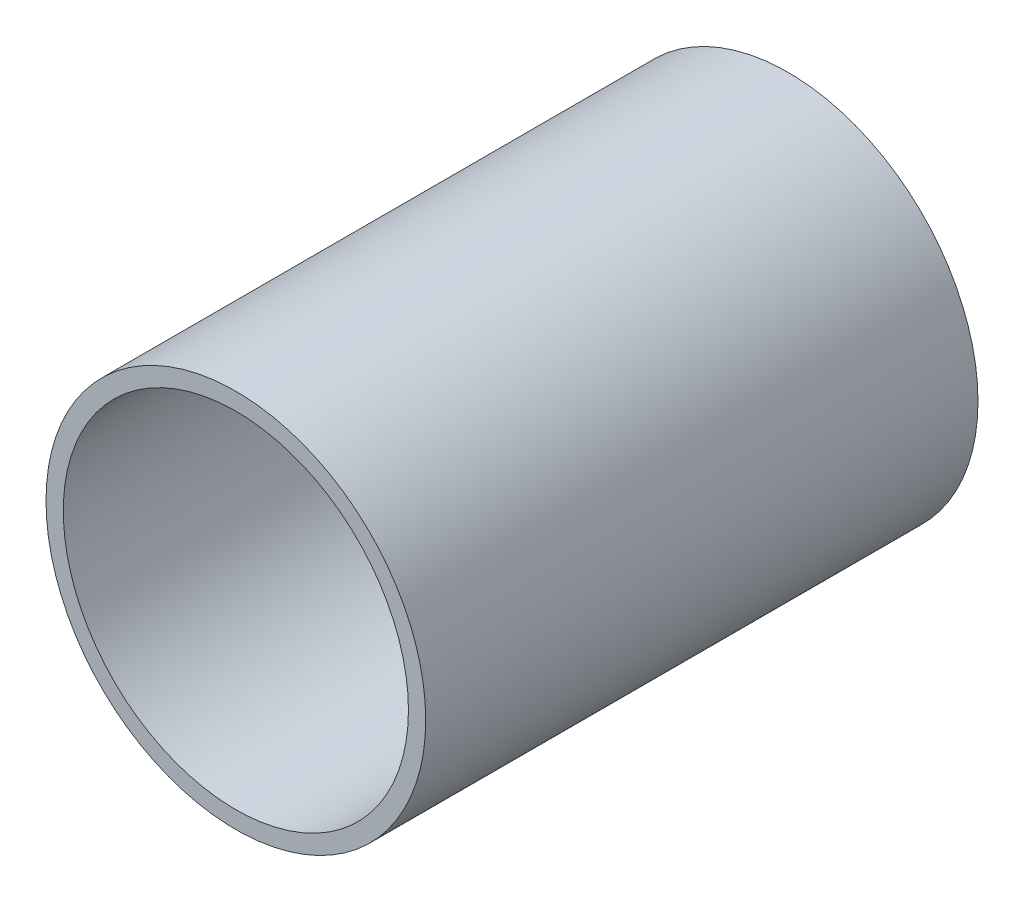
ISO-10303-21;
HEADER;
FILE_DESCRIPTION(('STEP AP214'),'2;1');
FILE_NAME('part.step','',(''),(''),'','','');
FILE_SCHEMA(('AUTOMOTIVE_DESIGN { 1 0 10303 214 1 1 1 1 }'));
ENDSEC;
DATA;
#1=APPLICATION_CONTEXT('core data for automotive mechanical design processes');
#2=APPLICATION_PROTOCOL_DEFINITION('international standard','automotive_design',2000,#1);
#3=PRODUCT_CONTEXT('',#1,'mechanical');
#4=PRODUCT('Part','Part','',(#3));
#5=PRODUCT_RELATED_PRODUCT_CATEGORY('part','',(#4));
#6=PRODUCT_DEFINITION_FORMATION('','',#4);
#7=PRODUCT_DEFINITION_CONTEXT('part definition',#1,'design');
#8=PRODUCT_DEFINITION('design','',#6,#7);
#9=PRODUCT_DEFINITION_SHAPE('','',#8);
#10=(LENGTH_UNIT() NAMED_UNIT(*) SI_UNIT(.MILLI.,.METRE.));
#11=(NAMED_UNIT(*) PLANE_ANGLE_UNIT() SI_UNIT($,.RADIAN.));
#12=(NAMED_UNIT(*) SI_UNIT($,.STERADIAN.) SOLID_ANGLE_UNIT());
#13=UNCERTAINTY_MEASURE_WITH_UNIT(LENGTH_MEASURE(1.E-05),#10,'distance_accuracy_value','');
#14=(GEOMETRIC_REPRESENTATION_CONTEXT(3) GLOBAL_UNCERTAINTY_ASSIGNED_CONTEXT((#13)) GLOBAL_UNIT_ASSIGNED_CONTEXT((#10,
#11,#12)) REPRESENTATION_CONTEXT('',''));
#15=CARTESIAN_POINT('',(0.,0.,0.));
#16=DIRECTION('',(0.,0.,1.));
#17=DIRECTION('',(1.,0.,0.));
#18=AXIS2_PLACEMENT_3D('',#15,#16,#17);
#19=CARTESIAN_POINT('',(0.,0.,40.));
#20=DIRECTION('',(0.,0.,1.));
#21=DIRECTION('',(1.,0.,0.));
#22=AXIS2_PLACEMENT_3D('',#19,#20,#21);
#23=PLANE('',#22);
#24=CARTESIAN_POINT('',(0.,0.,40.));
#25=DIRECTION('',(0.,0.,1.));
#26=DIRECTION('',(1.,0.,0.));
#27=AXIS2_PLACEMENT_3D('',#24,#25,#26);
#28=CIRCLE('',#27,13.75);
#29=CARTESIAN_POINT('',(13.75,0.,40.));
#30=VERTEX_POINT('',#29);
#31=EDGE_CURVE('E10',#30,#30,#28,.T.);
#32=ORIENTED_EDGE('',*,*,#31,.T.);
#33=EDGE_LOOP('',(#32));
#34=FACE_BOUND('',#33,.T.);
#35=CARTESIAN_POINT('',(0.,0.,40.));
#36=DIRECTION('',(0.,0.,1.));
#37=DIRECTION('',(1.,0.,0.));
#38=AXIS2_PLACEMENT_3D('',#35,#36,#37);
#39=CIRCLE('',#38,12.5);
#40=CARTESIAN_POINT('',(12.5,0.,40.));
#41=VERTEX_POINT('',#40);
#42=EDGE_CURVE('E40',#41,#41,#39,.T.);
#43=ORIENTED_EDGE('',*,*,#42,.F.);
#44=EDGE_LOOP('',(#43));
#45=FACE_BOUND('',#44,.T.);
#46=ADVANCED_FACE('F29',(#34,#45),#23,.T.);
#47=CARTESIAN_POINT('',(0.,0.,0.));
#48=DIRECTION('',(0.,0.,1.));
#49=DIRECTION('',(1.,0.,0.));
#50=AXIS2_PLACEMENT_3D('',#47,#48,#49);
#51=PLANE('',#50);
#52=CARTESIAN_POINT('',(0.,0.,0.));
#53=DIRECTION('',(0.,0.,1.));
#54=DIRECTION('',(1.,0.,0.));
#55=AXIS2_PLACEMENT_3D('',#52,#53,#54);
#56=CIRCLE('',#55,13.75);
#57=CARTESIAN_POINT('',(13.75,0.,0.));
#58=VERTEX_POINT('',#57);
#59=EDGE_CURVE('E36',#58,#58,#56,.T.);
#60=ORIENTED_EDGE('',*,*,#59,.F.);
#61=EDGE_LOOP('',(#60));
#62=FACE_BOUND('',#61,.T.);
#63=CARTESIAN_POINT('',(0.,0.,0.));
#64=DIRECTION('',(0.,0.,1.));
#65=DIRECTION('',(1.,0.,0.));
#66=AXIS2_PLACEMENT_3D('',#63,#64,#65);
#67=CIRCLE('',#66,12.5);
#68=CARTESIAN_POINT('',(12.5,0.,0.));
#69=VERTEX_POINT('',#68);
#70=EDGE_CURVE('E44',#69,#69,#67,.T.);
#71=ORIENTED_EDGE('',*,*,#70,.T.);
#72=EDGE_LOOP('',(#71));
#73=FACE_BOUND('',#72,.T.);
#74=ADVANCED_FACE('F50',(#62,#73),#51,.F.);
#75=CARTESIAN_POINT('',(0.,0.,40.));
#76=DIRECTION('',(0.,0.,-1.));
#77=DIRECTION('',(-1.,0.,0.));
#78=AXIS2_PLACEMENT_3D('',#75,#76,#77);
#79=CYLINDRICAL_SURFACE('',#78,13.75);
#80=ORIENTED_EDGE('',*,*,#31,.F.);
#81=EDGE_LOOP('',(#80));
#82=FACE_BOUND('',#81,.T.);
#83=ORIENTED_EDGE('',*,*,#59,.T.);
#84=EDGE_LOOP('',(#83));
#85=FACE_BOUND('',#84,.T.);
#86=ADVANCED_FACE('F31',(#82,#85),#79,.T.);
#87=CARTESIAN_POINT('',(0.,0.,40.));
#88=DIRECTION('',(0.,0.,-1.));
#89=DIRECTION('',(-1.,0.,0.));
#90=AXIS2_PLACEMENT_3D('',#87,#88,#89);
#91=CYLINDRICAL_SURFACE('',#90,12.5);
#92=ORIENTED_EDGE('',*,*,#42,.T.);
#93=EDGE_LOOP('',(#92));
#94=FACE_BOUND('',#93,.T.);
#95=ORIENTED_EDGE('',*,*,#70,.F.);
#96=EDGE_LOOP('',(#95));
#97=FACE_BOUND('',#96,.T.);
#98=ADVANCED_FACE('F52',(#94,#97),#91,.F.);
#99=CLOSED_SHELL('',(#46,#74,#86,#98));
#100=MANIFOLD_SOLID_BREP('B2',#99);
#101=ADVANCED_BREP_SHAPE_REPRESENTATION('',(#18,#100),#14);
#102=SHAPE_DEFINITION_REPRESENTATION(#9,#101);
ENDSEC;
END-ISO-10303-21;
